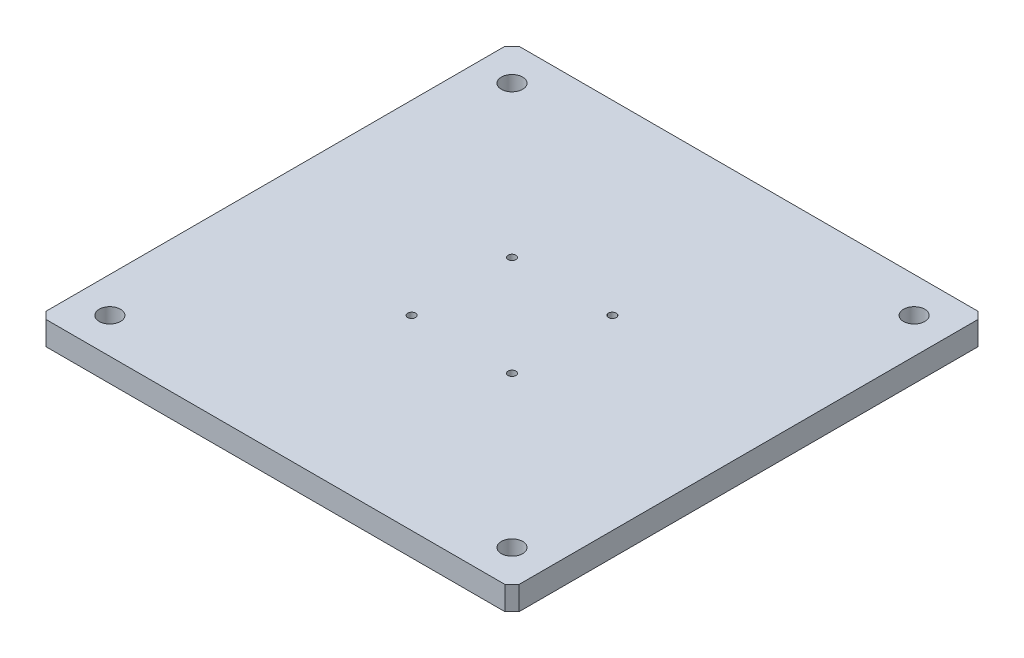
ISO-10303-21;
HEADER;
FILE_DESCRIPTION(('STEP AP214'),'2;1');
FILE_NAME('part.step','',(''),(''),'','','');
FILE_SCHEMA(('AUTOMOTIVE_DESIGN { 1 0 10303 214 1 1 1 1 }'));
ENDSEC;
DATA;
#1=APPLICATION_CONTEXT('core data for automotive mechanical design processes');
#2=APPLICATION_PROTOCOL_DEFINITION('international standard','automotive_design',2000,#1);
#3=PRODUCT_CONTEXT('',#1,'mechanical');
#4=PRODUCT('Part','Part','',(#3));
#5=PRODUCT_RELATED_PRODUCT_CATEGORY('part','',(#4));
#6=PRODUCT_DEFINITION_FORMATION('','',#4);
#7=PRODUCT_DEFINITION_CONTEXT('part definition',#1,'design');
#8=PRODUCT_DEFINITION('design','',#6,#7);
#9=PRODUCT_DEFINITION_SHAPE('','',#8);
#10=(LENGTH_UNIT() NAMED_UNIT(*) SI_UNIT(.MILLI.,.METRE.));
#11=(NAMED_UNIT(*) PLANE_ANGLE_UNIT() SI_UNIT($,.RADIAN.));
#12=(NAMED_UNIT(*) SI_UNIT($,.STERADIAN.) SOLID_ANGLE_UNIT());
#13=UNCERTAINTY_MEASURE_WITH_UNIT(LENGTH_MEASURE(1.E-05),#10,'distance_accuracy_value','');
#14=(GEOMETRIC_REPRESENTATION_CONTEXT(3) GLOBAL_UNCERTAINTY_ASSIGNED_CONTEXT((#13)) GLOBAL_UNIT_ASSIGNED_CONTEXT((#10,
#11,#12)) REPRESENTATION_CONTEXT('',''));
#15=CARTESIAN_POINT('',(0.,0.,0.));
#16=DIRECTION('',(0.,0.,1.));
#17=DIRECTION('',(1.,0.,0.));
#18=AXIS2_PLACEMENT_3D('',#15,#16,#17);
#19=CARTESIAN_POINT('',(0.,10.,-100.));
#20=DIRECTION('',(0.,-1.,0.));
#21=DIRECTION('',(0.,0.,-1.));
#22=AXIS2_PLACEMENT_3D('',#19,#20,#21);
#23=PLANE('',#22);
#24=CARTESIAN_POINT('',(121.213203435597,10.,21.2132034355963));
#25=DIRECTION('',(0.,1.,0.));
#26=DIRECTION('',(0.,0.,1.));
#27=AXIS2_PLACEMENT_3D('',#24,#25,#26);
#28=CIRCLE('',#27,1.64999999999998);
#29=CARTESIAN_POINT('',(121.213203435597,10.,22.8632034355963));
#30=VERTEX_POINT('',#29);
#31=EDGE_CURVE('E230',#30,#30,#28,.T.);
#32=ORIENTED_EDGE('',*,*,#31,.F.);
#33=EDGE_LOOP('',(#32));
#34=FACE_BOUND('',#33,.T.);
#35=CARTESIAN_POINT('',(78.7867965644035,10.,-21.2132034355963));
#36=DIRECTION('',(0.,1.,0.));
#37=DIRECTION('',(0.,0.,1.));
#38=AXIS2_PLACEMENT_3D('',#35,#36,#37);
#39=CIRCLE('',#38,1.64999999999998);
#40=CARTESIAN_POINT('',(78.7867965644035,10.,-19.5632034355963));
#41=VERTEX_POINT('',#40);
#42=EDGE_CURVE('E218',#41,#41,#39,.T.);
#43=ORIENTED_EDGE('',*,*,#42,.F.);
#44=EDGE_LOOP('',(#43));
#45=FACE_BOUND('',#44,.T.);
#46=CARTESIAN_POINT('',(15.,10.,-85.));
#47=DIRECTION('',(0.,1.,0.));
#48=DIRECTION('',(0.,0.,1.));
#49=AXIS2_PLACEMENT_3D('',#46,#47,#48);
#50=CIRCLE('',#49,4.5);
#51=CARTESIAN_POINT('',(15.,10.,-80.5));
#52=VERTEX_POINT('',#51);
#53=EDGE_CURVE('E206',#52,#52,#50,.T.);
#54=ORIENTED_EDGE('',*,*,#53,.F.);
#55=EDGE_LOOP('',(#54));
#56=FACE_BOUND('',#55,.T.);
#57=CARTESIAN_POINT('',(185.,10.,-85.));
#58=DIRECTION('',(0.,1.,0.));
#59=DIRECTION('',(0.,0.,1.));
#60=AXIS2_PLACEMENT_3D('',#57,#58,#59);
#61=CIRCLE('',#60,4.5);
#62=CARTESIAN_POINT('',(185.,10.,-80.5));
#63=VERTEX_POINT('',#62);
#64=EDGE_CURVE('E200',#63,#63,#61,.T.);
#65=ORIENTED_EDGE('',*,*,#64,.F.);
#66=EDGE_LOOP('',(#65));
#67=FACE_BOUND('',#66,.T.);
#68=CARTESIAN_POINT('',(185.,10.,85.));
#69=DIRECTION('',(0.,1.,0.));
#70=DIRECTION('',(0.,0.,1.));
#71=AXIS2_PLACEMENT_3D('',#68,#69,#70);
#72=CIRCLE('',#71,4.5);
#73=CARTESIAN_POINT('',(185.,10.,89.5));
#74=VERTEX_POINT('',#73);
#75=EDGE_CURVE('E145',#74,#74,#72,.T.);
#76=ORIENTED_EDGE('',*,*,#75,.F.);
#77=EDGE_LOOP('',(#76));
#78=FACE_BOUND('',#77,.T.);
#79=DIRECTION('',(-1.,0.,0.));
#80=VECTOR('',#79,1.);
#81=CARTESIAN_POINT('',(0.,10.,-100.));
#82=LINE('',#81,#80);
#83=CARTESIAN_POINT('',(197.,10.,-100.));
#84=VERTEX_POINT('',#83);
#85=CARTESIAN_POINT('',(3.00000000000003,10.,-100.));
#86=VERTEX_POINT('',#85);
#87=EDGE_CURVE('E148',#84,#86,#82,.T.);
#88=ORIENTED_EDGE('',*,*,#87,.T.);
#89=DIRECTION('',(0.707106781186548,0.,-0.707106781186548));
#90=VECTOR('',#89,1.);
#91=CARTESIAN_POINT('',(0.,10.,-97.));
#92=LINE('',#91,#90);
#93=CARTESIAN_POINT('',(0.,10.,-96.9999999999999));
#94=VERTEX_POINT('',#93);
#95=EDGE_CURVE('E166',#86,#94,#92,.F.);
#96=ORIENTED_EDGE('',*,*,#95,.T.);
#97=DIRECTION('',(0.,0.,1.));
#98=VECTOR('',#97,1.);
#99=CARTESIAN_POINT('',(0.,10.,100.));
#100=LINE('',#99,#98);
#101=CARTESIAN_POINT('',(0.,10.,97.));
#102=VERTEX_POINT('',#101);
#103=EDGE_CURVE('E130',#94,#102,#100,.T.);
#104=ORIENTED_EDGE('',*,*,#103,.T.);
#105=DIRECTION('',(-0.707106781186548,0.,-0.707106781186548));
#106=VECTOR('',#105,1.);
#107=CARTESIAN_POINT('',(3.,10.,100.));
#108=LINE('',#107,#106);
#109=CARTESIAN_POINT('',(3.,10.,100.));
#110=VERTEX_POINT('',#109);
#111=EDGE_CURVE('E162',#102,#110,#108,.F.);
#112=ORIENTED_EDGE('',*,*,#111,.T.);
#113=DIRECTION('',(1.,0.,0.));
#114=VECTOR('',#113,1.);
#115=CARTESIAN_POINT('',(0.,10.,100.));
#116=LINE('',#115,#114);
#117=CARTESIAN_POINT('',(197.,10.,100.));
#118=VERTEX_POINT('',#117);
#119=EDGE_CURVE('E175',#110,#118,#116,.T.);
#120=ORIENTED_EDGE('',*,*,#119,.T.);
#121=DIRECTION('',(-0.707106781186548,0.,0.707106781186548));
#122=VECTOR('',#121,1.);
#123=CARTESIAN_POINT('',(200.,10.,97.));
#124=LINE('',#123,#122);
#125=CARTESIAN_POINT('',(200.,10.,97.));
#126=VERTEX_POINT('',#125);
#127=EDGE_CURVE('E65',#118,#126,#124,.F.);
#128=ORIENTED_EDGE('',*,*,#127,.T.);
#129=DIRECTION('',(0.,0.,-1.));
#130=VECTOR('',#129,1.);
#131=CARTESIAN_POINT('',(200.,10.,100.));
#132=LINE('',#131,#130);
#133=CARTESIAN_POINT('',(200.,10.,-97.));
#134=VERTEX_POINT('',#133);
#135=EDGE_CURVE('E181',#126,#134,#132,.T.);
#136=ORIENTED_EDGE('',*,*,#135,.T.);
#137=DIRECTION('',(0.707106781186548,0.,0.707106781186548));
#138=VECTOR('',#137,1.);
#139=CARTESIAN_POINT('',(197.,10.,-100.));
#140=LINE('',#139,#138);
#141=EDGE_CURVE('E164',#134,#84,#140,.F.);
#142=ORIENTED_EDGE('',*,*,#141,.T.);
#143=EDGE_LOOP('',(#88,#96,#104,#112,#120,#128,#136,#142));
#144=FACE_BOUND('',#143,.T.);
#145=CARTESIAN_POINT('',(15.,10.,85.));
#146=DIRECTION('',(0.,1.,0.));
#147=DIRECTION('',(0.,0.,1.));
#148=AXIS2_PLACEMENT_3D('',#145,#146,#147);
#149=CIRCLE('',#148,4.5);
#150=CARTESIAN_POINT('',(15.,10.,89.5));
#151=VERTEX_POINT('',#150);
#152=EDGE_CURVE('E212',#151,#151,#149,.T.);
#153=ORIENTED_EDGE('',*,*,#152,.F.);
#154=EDGE_LOOP('',(#153));
#155=FACE_BOUND('',#154,.T.);
#156=CARTESIAN_POINT('',(121.213203435596,10.,-21.2132034355965));
#157=DIRECTION('',(0.,1.,0.));
#158=DIRECTION('',(0.,0.,1.));
#159=AXIS2_PLACEMENT_3D('',#156,#157,#158);
#160=CIRCLE('',#159,1.64999999999998);
#161=CARTESIAN_POINT('',(121.213203435596,10.,-19.5632034355965));
#162=VERTEX_POINT('',#161);
#163=EDGE_CURVE('E224',#162,#162,#160,.T.);
#164=ORIENTED_EDGE('',*,*,#163,.F.);
#165=EDGE_LOOP('',(#164));
#166=FACE_BOUND('',#165,.T.);
#167=CARTESIAN_POINT('',(78.7867965644036,10.,21.2132034355965));
#168=DIRECTION('',(0.,1.,0.));
#169=DIRECTION('',(0.,0.,1.));
#170=AXIS2_PLACEMENT_3D('',#167,#168,#169);
#171=CIRCLE('',#170,1.64999999999998);
#172=CARTESIAN_POINT('',(78.7867965644036,10.,22.8632034355964));
#173=VERTEX_POINT('',#172);
#174=EDGE_CURVE('E236',#173,#173,#171,.T.);
#175=ORIENTED_EDGE('',*,*,#174,.F.);
#176=EDGE_LOOP('',(#175));
#177=FACE_BOUND('',#176,.T.);
#178=ADVANCED_FACE('F43',(#34,#45,#56,#67,#78,#144,#155,#166,#177),#23,.F.);
#179=CARTESIAN_POINT('',(0.,0.,-100.));
#180=DIRECTION('',(0.,-1.,0.));
#181=DIRECTION('',(0.,0.,-1.));
#182=AXIS2_PLACEMENT_3D('',#179,#180,#181);
#183=PLANE('',#182);
#184=CARTESIAN_POINT('',(121.213203435597,0.,21.2132034355963));
#185=DIRECTION('',(0.,1.,0.));
#186=DIRECTION('',(0.,0.,1.));
#187=AXIS2_PLACEMENT_3D('',#184,#185,#186);
#188=CIRCLE('',#187,1.65);
#189=CARTESIAN_POINT('',(121.213203435597,0.,22.8632034355963));
#190=VERTEX_POINT('',#189);
#191=EDGE_CURVE('E227',#190,#190,#188,.T.);
#192=ORIENTED_EDGE('',*,*,#191,.T.);
#193=EDGE_LOOP('',(#192));
#194=FACE_BOUND('',#193,.T.);
#195=CARTESIAN_POINT('',(15.,0.,85.));
#196=DIRECTION('',(0.,1.,0.));
#197=DIRECTION('',(0.,0.,1.));
#198=AXIS2_PLACEMENT_3D('',#195,#196,#197);
#199=CIRCLE('',#198,4.5);
#200=CARTESIAN_POINT('',(15.,0.,89.5));
#201=VERTEX_POINT('',#200);
#202=EDGE_CURVE('E209',#201,#201,#199,.T.);
#203=ORIENTED_EDGE('',*,*,#202,.T.);
#204=EDGE_LOOP('',(#203));
#205=FACE_BOUND('',#204,.T.);
#206=CARTESIAN_POINT('',(185.,0.,-85.));
#207=DIRECTION('',(0.,1.,0.));
#208=DIRECTION('',(0.,0.,1.));
#209=AXIS2_PLACEMENT_3D('',#206,#207,#208);
#210=CIRCLE('',#209,4.5);
#211=CARTESIAN_POINT('',(185.,0.,-80.5));
#212=VERTEX_POINT('',#211);
#213=EDGE_CURVE('E197',#212,#212,#210,.T.);
#214=ORIENTED_EDGE('',*,*,#213,.T.);
#215=EDGE_LOOP('',(#214));
#216=FACE_BOUND('',#215,.T.);
#217=CARTESIAN_POINT('',(185.,0.,85.));
#218=DIRECTION('',(0.,1.,0.));
#219=DIRECTION('',(0.,0.,1.));
#220=AXIS2_PLACEMENT_3D('',#217,#218,#219);
#221=CIRCLE('',#220,4.5);
#222=CARTESIAN_POINT('',(185.,0.,89.5));
#223=VERTEX_POINT('',#222);
#224=EDGE_CURVE('E139',#223,#223,#221,.T.);
#225=ORIENTED_EDGE('',*,*,#224,.T.);
#226=EDGE_LOOP('',(#225));
#227=FACE_BOUND('',#226,.T.);
#228=DIRECTION('',(0.,0.,1.));
#229=VECTOR('',#228,1.);
#230=CARTESIAN_POINT('',(0.,0.,100.));
#231=LINE('',#230,#229);
#232=CARTESIAN_POINT('',(0.,0.,-96.9999999999999));
#233=VERTEX_POINT('',#232);
#234=CARTESIAN_POINT('',(0.,0.,97.));
#235=VERTEX_POINT('',#234);
#236=EDGE_CURVE('E127',#233,#235,#231,.T.);
#237=ORIENTED_EDGE('',*,*,#236,.F.);
#238=DIRECTION('',(-0.707106781186548,0.,0.707106781186548));
#239=VECTOR('',#238,1.);
#240=CARTESIAN_POINT('',(1.50000000000002,0.,-98.5));
#241=LINE('',#240,#239);
#242=CARTESIAN_POINT('',(3.00000000000003,0.,-100.));
#243=VERTEX_POINT('',#242);
#244=EDGE_CURVE('E110',#233,#243,#241,.F.);
#245=ORIENTED_EDGE('',*,*,#244,.T.);
#246=DIRECTION('',(-1.,0.,0.));
#247=VECTOR('',#246,1.);
#248=CARTESIAN_POINT('',(0.,0.,-100.));
#249=LINE('',#248,#247);
#250=CARTESIAN_POINT('',(197.,0.,-100.));
#251=VERTEX_POINT('',#250);
#252=EDGE_CURVE('E152',#251,#243,#249,.T.);
#253=ORIENTED_EDGE('',*,*,#252,.F.);
#254=DIRECTION('',(-0.707106781186548,0.,-0.707106781186548));
#255=VECTOR('',#254,1.);
#256=CARTESIAN_POINT('',(98.5,0.,-198.5));
#257=LINE('',#256,#255);
#258=CARTESIAN_POINT('',(200.,0.,-97.));
#259=VERTEX_POINT('',#258);
#260=EDGE_CURVE('E121',#251,#259,#257,.F.);
#261=ORIENTED_EDGE('',*,*,#260,.T.);
#262=DIRECTION('',(0.,0.,-1.));
#263=VECTOR('',#262,1.);
#264=CARTESIAN_POINT('',(200.,0.,100.));
#265=LINE('',#264,#263);
#266=CARTESIAN_POINT('',(200.,0.,97.));
#267=VERTEX_POINT('',#266);
#268=EDGE_CURVE('E142',#267,#259,#265,.T.);
#269=ORIENTED_EDGE('',*,*,#268,.F.);
#270=DIRECTION('',(0.707106781186548,0.,-0.707106781186548));
#271=VECTOR('',#270,1.);
#272=CARTESIAN_POINT('',(198.5,0.,98.5));
#273=LINE('',#272,#271);
#274=CARTESIAN_POINT('',(197.,0.,100.));
#275=VERTEX_POINT('',#274);
#276=EDGE_CURVE('E131',#267,#275,#273,.F.);
#277=ORIENTED_EDGE('',*,*,#276,.T.);
#278=DIRECTION('',(1.,0.,0.));
#279=VECTOR('',#278,1.);
#280=CARTESIAN_POINT('',(0.,0.,100.));
#281=LINE('',#280,#279);
#282=CARTESIAN_POINT('',(3.00000000000001,0.,100.));
#283=VERTEX_POINT('',#282);
#284=EDGE_CURVE('E138',#283,#275,#281,.T.);
#285=ORIENTED_EDGE('',*,*,#284,.F.);
#286=DIRECTION('',(0.707106781186548,0.,0.707106781186548));
#287=VECTOR('',#286,1.);
#288=CARTESIAN_POINT('',(-98.5,0.,-1.5));
#289=LINE('',#288,#287);
#290=EDGE_CURVE('E137',#283,#235,#289,.F.);
#291=ORIENTED_EDGE('',*,*,#290,.T.);
#292=EDGE_LOOP('',(#237,#245,#253,#261,#269,#277,#285,#291));
#293=FACE_BOUND('',#292,.T.);
#294=CARTESIAN_POINT('',(15.,0.,-85.));
#295=DIRECTION('',(0.,1.,0.));
#296=DIRECTION('',(0.,0.,1.));
#297=AXIS2_PLACEMENT_3D('',#294,#295,#296);
#298=CIRCLE('',#297,4.5);
#299=CARTESIAN_POINT('',(15.,0.,-80.5));
#300=VERTEX_POINT('',#299);
#301=EDGE_CURVE('E203',#300,#300,#298,.T.);
#302=ORIENTED_EDGE('',*,*,#301,.T.);
#303=EDGE_LOOP('',(#302));
#304=FACE_BOUND('',#303,.T.);
#305=CARTESIAN_POINT('',(78.7867965644035,0.,-21.2132034355963));
#306=DIRECTION('',(0.,1.,0.));
#307=DIRECTION('',(0.,0.,1.));
#308=AXIS2_PLACEMENT_3D('',#305,#306,#307);
#309=CIRCLE('',#308,1.65);
#310=CARTESIAN_POINT('',(78.7867965644035,0.,-19.5632034355963));
#311=VERTEX_POINT('',#310);
#312=EDGE_CURVE('E215',#311,#311,#309,.T.);
#313=ORIENTED_EDGE('',*,*,#312,.T.);
#314=EDGE_LOOP('',(#313));
#315=FACE_BOUND('',#314,.T.);
#316=CARTESIAN_POINT('',(121.213203435596,0.,-21.2132034355965));
#317=DIRECTION('',(0.,1.,0.));
#318=DIRECTION('',(0.,0.,1.));
#319=AXIS2_PLACEMENT_3D('',#316,#317,#318);
#320=CIRCLE('',#319,1.65);
#321=CARTESIAN_POINT('',(121.213203435596,0.,-19.5632034355965));
#322=VERTEX_POINT('',#321);
#323=EDGE_CURVE('E221',#322,#322,#320,.T.);
#324=ORIENTED_EDGE('',*,*,#323,.T.);
#325=EDGE_LOOP('',(#324));
#326=FACE_BOUND('',#325,.T.);
#327=CARTESIAN_POINT('',(78.7867965644036,0.,21.2132034355965));
#328=DIRECTION('',(0.,1.,0.));
#329=DIRECTION('',(0.,0.,1.));
#330=AXIS2_PLACEMENT_3D('',#327,#328,#329);
#331=CIRCLE('',#330,1.65);
#332=CARTESIAN_POINT('',(78.7867965644036,0.,22.8632034355964));
#333=VERTEX_POINT('',#332);
#334=EDGE_CURVE('E233',#333,#333,#331,.T.);
#335=ORIENTED_EDGE('',*,*,#334,.T.);
#336=EDGE_LOOP('',(#335));
#337=FACE_BOUND('',#336,.T.);
#338=ADVANCED_FACE('F134',(#194,#205,#216,#227,#293,#304,#315,#326,#337),#183,.T.);
#339=CARTESIAN_POINT('',(0.,10.,100.));
#340=DIRECTION('',(1.,0.,0.));
#341=DIRECTION('',(0.,0.,-1.));
#342=AXIS2_PLACEMENT_3D('',#339,#340,#341);
#343=PLANE('',#342);
#344=ORIENTED_EDGE('',*,*,#103,.F.);
#345=DIRECTION('',(0.,-1.,0.));
#346=VECTOR('',#345,1.);
#347=CARTESIAN_POINT('',(0.,10.,-97.));
#348=LINE('',#347,#346);
#349=EDGE_CURVE('E114',#94,#233,#348,.T.);
#350=ORIENTED_EDGE('',*,*,#349,.T.);
#351=ORIENTED_EDGE('',*,*,#236,.T.);
#352=DIRECTION('',(0.,1.,0.));
#353=VECTOR('',#352,1.);
#354=CARTESIAN_POINT('',(0.,10.,97.));
#355=LINE('',#354,#353);
#356=EDGE_CURVE('E132',#235,#102,#355,.T.);
#357=ORIENTED_EDGE('',*,*,#356,.T.);
#358=EDGE_LOOP('',(#344,#350,#351,#357));
#359=FACE_BOUND('',#358,.T.);
#360=ADVANCED_FACE('F126',(#359),#343,.F.);
#361=CARTESIAN_POINT('',(0.,10.,100.));
#362=DIRECTION('',(0.,0.,-1.));
#363=DIRECTION('',(-1.,0.,0.));
#364=AXIS2_PLACEMENT_3D('',#361,#362,#363);
#365=PLANE('',#364);
#366=ORIENTED_EDGE('',*,*,#119,.F.);
#367=DIRECTION('',(0.,-1.,0.));
#368=VECTOR('',#367,1.);
#369=CARTESIAN_POINT('',(3.,10.,100.));
#370=LINE('',#369,#368);
#371=EDGE_CURVE('E11',#110,#283,#370,.T.);
#372=ORIENTED_EDGE('',*,*,#371,.T.);
#373=ORIENTED_EDGE('',*,*,#284,.T.);
#374=DIRECTION('',(0.,1.,0.));
#375=VECTOR('',#374,1.);
#376=CARTESIAN_POINT('',(197.,10.,100.));
#377=LINE('',#376,#375);
#378=EDGE_CURVE('E51',#275,#118,#377,.T.);
#379=ORIENTED_EDGE('',*,*,#378,.T.);
#380=EDGE_LOOP('',(#366,#372,#373,#379));
#381=FACE_BOUND('',#380,.T.);
#382=ADVANCED_FACE('F174',(#381),#365,.F.);
#383=CARTESIAN_POINT('',(200.,10.,100.));
#384=DIRECTION('',(-1.,0.,0.));
#385=DIRECTION('',(0.,0.,1.));
#386=AXIS2_PLACEMENT_3D('',#383,#384,#385);
#387=PLANE('',#386);
#388=ORIENTED_EDGE('',*,*,#268,.T.);
#389=DIRECTION('',(0.,1.,0.));
#390=VECTOR('',#389,1.);
#391=CARTESIAN_POINT('',(200.,10.,-97.));
#392=LINE('',#391,#390);
#393=EDGE_CURVE('E58',#259,#134,#392,.T.);
#394=ORIENTED_EDGE('',*,*,#393,.T.);
#395=ORIENTED_EDGE('',*,*,#135,.F.);
#396=DIRECTION('',(0.,-1.,0.));
#397=VECTOR('',#396,1.);
#398=CARTESIAN_POINT('',(200.,10.,97.));
#399=LINE('',#398,#397);
#400=EDGE_CURVE('E168',#126,#267,#399,.T.);
#401=ORIENTED_EDGE('',*,*,#400,.T.);
#402=EDGE_LOOP('',(#388,#394,#395,#401));
#403=FACE_BOUND('',#402,.T.);
#404=ADVANCED_FACE('F185',(#403),#387,.F.);
#405=CARTESIAN_POINT('',(0.,10.,-100.));
#406=DIRECTION('',(0.,0.,1.));
#407=DIRECTION('',(1.,0.,0.));
#408=AXIS2_PLACEMENT_3D('',#405,#406,#407);
#409=PLANE('',#408);
#410=ORIENTED_EDGE('',*,*,#252,.T.);
#411=DIRECTION('',(0.,1.,0.));
#412=VECTOR('',#411,1.);
#413=CARTESIAN_POINT('',(3.00000000000003,10.,-100.));
#414=LINE('',#413,#412);
#415=EDGE_CURVE('E115',#243,#86,#414,.T.);
#416=ORIENTED_EDGE('',*,*,#415,.T.);
#417=ORIENTED_EDGE('',*,*,#87,.F.);
#418=DIRECTION('',(0.,-1.,0.));
#419=VECTOR('',#418,1.);
#420=CARTESIAN_POINT('',(197.,10.,-100.));
#421=LINE('',#420,#419);
#422=EDGE_CURVE('E120',#84,#251,#421,.T.);
#423=ORIENTED_EDGE('',*,*,#422,.T.);
#424=EDGE_LOOP('',(#410,#416,#417,#423));
#425=FACE_BOUND('',#424,.T.);
#426=ADVANCED_FACE('F192',(#425),#409,.F.);
#427=CARTESIAN_POINT('',(185.,10.,85.));
#428=DIRECTION('',(0.,1.,0.));
#429=DIRECTION('',(0.,0.,1.));
#430=AXIS2_PLACEMENT_3D('',#427,#428,#429);
#431=CYLINDRICAL_SURFACE('',#430,4.5);
#432=ORIENTED_EDGE('',*,*,#224,.F.);
#433=EDGE_LOOP('',(#432));
#434=FACE_BOUND('',#433,.T.);
#435=ORIENTED_EDGE('',*,*,#75,.T.);
#436=EDGE_LOOP('',(#435));
#437=FACE_BOUND('',#436,.T.);
#438=ADVANCED_FACE('F254',(#434,#437),#431,.F.);
#439=CARTESIAN_POINT('',(185.,10.,-85.));
#440=DIRECTION('',(0.,1.,0.));
#441=DIRECTION('',(0.,0.,1.));
#442=AXIS2_PLACEMENT_3D('',#439,#440,#441);
#443=CYLINDRICAL_SURFACE('',#442,4.5);
#444=ORIENTED_EDGE('',*,*,#213,.F.);
#445=EDGE_LOOP('',(#444));
#446=FACE_BOUND('',#445,.T.);
#447=ORIENTED_EDGE('',*,*,#64,.T.);
#448=EDGE_LOOP('',(#447));
#449=FACE_BOUND('',#448,.T.);
#450=ADVANCED_FACE('F346',(#446,#449),#443,.F.);
#451=CARTESIAN_POINT('',(15.,10.,-85.));
#452=DIRECTION('',(0.,1.,0.));
#453=DIRECTION('',(0.,0.,1.));
#454=AXIS2_PLACEMENT_3D('',#451,#452,#453);
#455=CYLINDRICAL_SURFACE('',#454,4.5);
#456=ORIENTED_EDGE('',*,*,#301,.F.);
#457=EDGE_LOOP('',(#456));
#458=FACE_BOUND('',#457,.T.);
#459=ORIENTED_EDGE('',*,*,#53,.T.);
#460=EDGE_LOOP('',(#459));
#461=FACE_BOUND('',#460,.T.);
#462=ADVANCED_FACE('F338',(#458,#461),#455,.F.);
#463=CARTESIAN_POINT('',(15.,10.,85.));
#464=DIRECTION('',(0.,1.,0.));
#465=DIRECTION('',(0.,0.,1.));
#466=AXIS2_PLACEMENT_3D('',#463,#464,#465);
#467=CYLINDRICAL_SURFACE('',#466,4.5);
#468=ORIENTED_EDGE('',*,*,#202,.F.);
#469=EDGE_LOOP('',(#468));
#470=FACE_BOUND('',#469,.T.);
#471=ORIENTED_EDGE('',*,*,#152,.T.);
#472=EDGE_LOOP('',(#471));
#473=FACE_BOUND('',#472,.T.);
#474=ADVANCED_FACE('F322',(#470,#473),#467,.F.);
#475=CARTESIAN_POINT('',(78.7867965644035,10.,-21.2132034355963));
#476=DIRECTION('',(0.,1.,0.));
#477=DIRECTION('',(0.,0.,1.));
#478=AXIS2_PLACEMENT_3D('',#475,#476,#477);
#479=CYLINDRICAL_SURFACE('',#478,1.64999999999999);
#480=ORIENTED_EDGE('',*,*,#312,.F.);
#481=EDGE_LOOP('',(#480));
#482=FACE_BOUND('',#481,.T.);
#483=ORIENTED_EDGE('',*,*,#42,.T.);
#484=EDGE_LOOP('',(#483));
#485=FACE_BOUND('',#484,.T.);
#486=ADVANCED_FACE('F313',(#482,#485),#479,.F.);
#487=CARTESIAN_POINT('',(121.213203435596,10.,-21.2132034355965));
#488=DIRECTION('',(0.,1.,0.));
#489=DIRECTION('',(0.,0.,1.));
#490=AXIS2_PLACEMENT_3D('',#487,#488,#489);
#491=CYLINDRICAL_SURFACE('',#490,1.64999999999999);
#492=ORIENTED_EDGE('',*,*,#323,.F.);
#493=EDGE_LOOP('',(#492));
#494=FACE_BOUND('',#493,.T.);
#495=ORIENTED_EDGE('',*,*,#163,.T.);
#496=EDGE_LOOP('',(#495));
#497=FACE_BOUND('',#496,.T.);
#498=ADVANCED_FACE('F303',(#494,#497),#491,.F.);
#499=CARTESIAN_POINT('',(121.213203435597,10.,21.2132034355963));
#500=DIRECTION('',(0.,1.,0.));
#501=DIRECTION('',(0.,0.,1.));
#502=AXIS2_PLACEMENT_3D('',#499,#500,#501);
#503=CYLINDRICAL_SURFACE('',#502,1.64999999999999);
#504=ORIENTED_EDGE('',*,*,#191,.F.);
#505=EDGE_LOOP('',(#504));
#506=FACE_BOUND('',#505,.T.);
#507=ORIENTED_EDGE('',*,*,#31,.T.);
#508=EDGE_LOOP('',(#507));
#509=FACE_BOUND('',#508,.T.);
#510=ADVANCED_FACE('F293',(#506,#509),#503,.F.);
#511=CARTESIAN_POINT('',(78.7867965644036,10.,21.2132034355965));
#512=DIRECTION('',(0.,1.,0.));
#513=DIRECTION('',(0.,0.,1.));
#514=AXIS2_PLACEMENT_3D('',#511,#512,#513);
#515=CYLINDRICAL_SURFACE('',#514,1.64999999999999);
#516=ORIENTED_EDGE('',*,*,#334,.F.);
#517=EDGE_LOOP('',(#516));
#518=FACE_BOUND('',#517,.T.);
#519=ORIENTED_EDGE('',*,*,#174,.T.);
#520=EDGE_LOOP('',(#519));
#521=FACE_BOUND('',#520,.T.);
#522=ADVANCED_FACE('F240',(#518,#521),#515,.F.);
#523=CARTESIAN_POINT('',(0.,10.,-97.));
#524=DIRECTION('',(0.707106781186547,0.,0.707106781186547));
#525=DIRECTION('',(0.707106781186548,0.,-0.707106781186548));
#526=AXIS2_PLACEMENT_3D('',#523,#524,#525);
#527=PLANE('',#526);
#528=ORIENTED_EDGE('',*,*,#95,.F.);
#529=ORIENTED_EDGE('',*,*,#415,.F.);
#530=ORIENTED_EDGE('',*,*,#244,.F.);
#531=ORIENTED_EDGE('',*,*,#349,.F.);
#532=EDGE_LOOP('',(#528,#529,#530,#531));
#533=FACE_BOUND('',#532,.T.);
#534=ADVANCED_FACE('F113',(#533),#527,.F.);
#535=CARTESIAN_POINT('',(197.,10.,-100.));
#536=DIRECTION('',(-0.707106781186547,0.,0.707106781186547));
#537=DIRECTION('',(0.707106781186548,0.,0.707106781186548));
#538=AXIS2_PLACEMENT_3D('',#535,#536,#537);
#539=PLANE('',#538);
#540=ORIENTED_EDGE('',*,*,#141,.F.);
#541=ORIENTED_EDGE('',*,*,#393,.F.);
#542=ORIENTED_EDGE('',*,*,#260,.F.);
#543=ORIENTED_EDGE('',*,*,#422,.F.);
#544=EDGE_LOOP('',(#540,#541,#542,#543));
#545=FACE_BOUND('',#544,.T.);
#546=ADVANCED_FACE('F189',(#545),#539,.F.);
#547=CARTESIAN_POINT('',(3.,10.,100.));
#548=DIRECTION('',(0.707106781186547,0.,-0.707106781186547));
#549=DIRECTION('',(-0.707106781186548,0.,-0.707106781186548));
#550=AXIS2_PLACEMENT_3D('',#547,#548,#549);
#551=PLANE('',#550);
#552=ORIENTED_EDGE('',*,*,#111,.F.);
#553=ORIENTED_EDGE('',*,*,#356,.F.);
#554=ORIENTED_EDGE('',*,*,#290,.F.);
#555=ORIENTED_EDGE('',*,*,#371,.F.);
#556=EDGE_LOOP('',(#552,#553,#554,#555));
#557=FACE_BOUND('',#556,.T.);
#558=ADVANCED_FACE('F268',(#557),#551,.F.);
#559=CARTESIAN_POINT('',(200.,10.,97.));
#560=DIRECTION('',(-0.707106781186547,0.,-0.707106781186547));
#561=DIRECTION('',(-0.707106781186548,0.,0.707106781186548));
#562=AXIS2_PLACEMENT_3D('',#559,#560,#561);
#563=PLANE('',#562);
#564=ORIENTED_EDGE('',*,*,#127,.F.);
#565=ORIENTED_EDGE('',*,*,#378,.F.);
#566=ORIENTED_EDGE('',*,*,#276,.F.);
#567=ORIENTED_EDGE('',*,*,#400,.F.);
#568=EDGE_LOOP('',(#564,#565,#566,#567));
#569=FACE_BOUND('',#568,.T.);
#570=ADVANCED_FACE('F45',(#569),#563,.F.);
#571=CLOSED_SHELL('',(#178,#338,#360,#382,#404,#426,#438,#450,#462,#474,#486,#498,#510,#522,
#534,#546,#558,#570));
#572=MANIFOLD_SOLID_BREP('B2',#571);
#573=ADVANCED_BREP_SHAPE_REPRESENTATION('',(#18,#572),#14);
#574=SHAPE_DEFINITION_REPRESENTATION(#9,#573);
ENDSEC;
END-ISO-10303-21;
